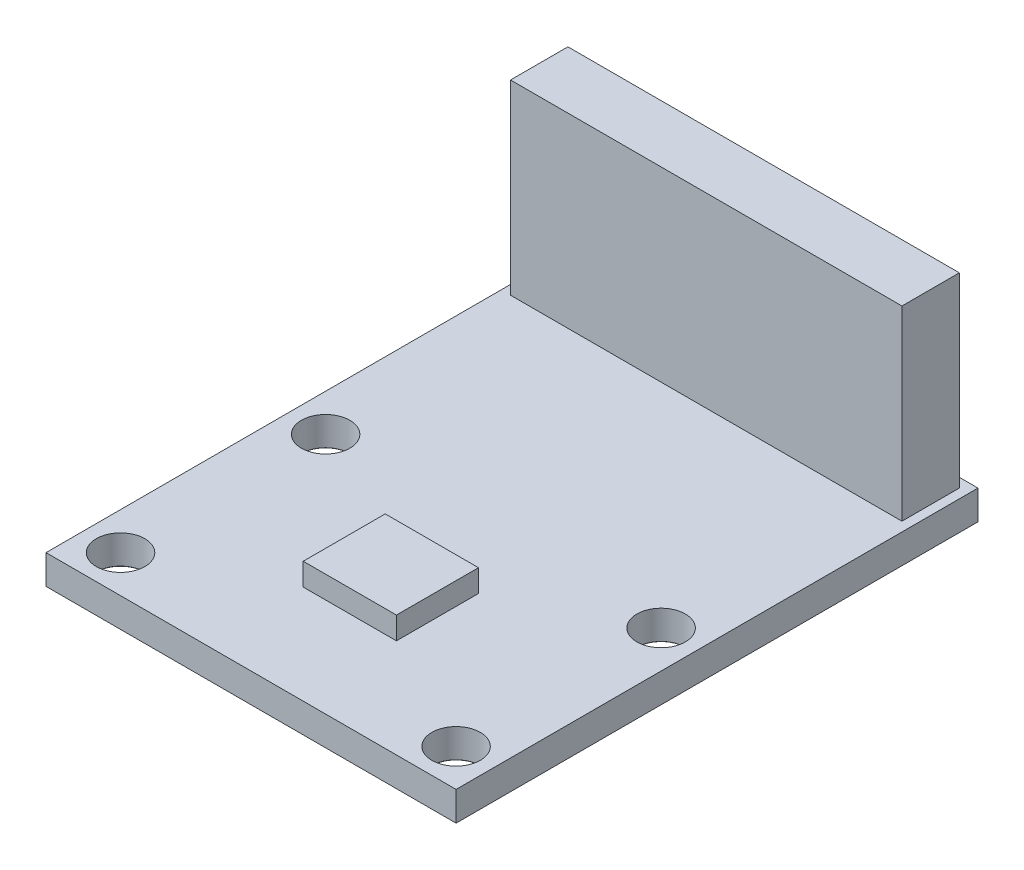
ISO-10303-21;
HEADER;
FILE_DESCRIPTION(('STEP AP214'),'2;1');
FILE_NAME('part.step','',(''),(''),'','','');
FILE_SCHEMA(('AUTOMOTIVE_DESIGN { 1 0 10303 214 1 1 1 1 }'));
ENDSEC;
DATA;
#1=APPLICATION_CONTEXT('core data for automotive mechanical design processes');
#2=APPLICATION_PROTOCOL_DEFINITION('international standard','automotive_design',2000,#1);
#3=PRODUCT_CONTEXT('',#1,'mechanical');
#4=PRODUCT('Part','Part','',(#3));
#5=PRODUCT_RELATED_PRODUCT_CATEGORY('part','',(#4));
#6=PRODUCT_DEFINITION_FORMATION('','',#4);
#7=PRODUCT_DEFINITION_CONTEXT('part definition',#1,'design');
#8=PRODUCT_DEFINITION('design','',#6,#7);
#9=PRODUCT_DEFINITION_SHAPE('','',#8);
#10=(LENGTH_UNIT() NAMED_UNIT(*) SI_UNIT(.MILLI.,.METRE.));
#11=(NAMED_UNIT(*) PLANE_ANGLE_UNIT() SI_UNIT($,.RADIAN.));
#12=(NAMED_UNIT(*) SI_UNIT($,.STERADIAN.) SOLID_ANGLE_UNIT());
#13=UNCERTAINTY_MEASURE_WITH_UNIT(LENGTH_MEASURE(1.E-05),#10,'distance_accuracy_value','');
#14=(GEOMETRIC_REPRESENTATION_CONTEXT(3) GLOBAL_UNCERTAINTY_ASSIGNED_CONTEXT((#13)) GLOBAL_UNIT_ASSIGNED_CONTEXT((#10,
#11,#12)) REPRESENTATION_CONTEXT('',''));
#15=CARTESIAN_POINT('',(0.,0.,0.));
#16=DIRECTION('',(0.,0.,1.));
#17=DIRECTION('',(1.,0.,0.));
#18=AXIS2_PLACEMENT_3D('',#15,#16,#17);
#19=CARTESIAN_POINT('',(0.,1.57,0.));
#20=DIRECTION('',(0.,1.,0.));
#21=DIRECTION('',(0.,0.,1.));
#22=AXIS2_PLACEMENT_3D('',#19,#20,#21);
#23=PLANE('',#22);
#24=CARTESIAN_POINT('',(-9.,1.57,-5.5));
#25=DIRECTION('',(0.,1.,0.));
#26=DIRECTION('',(0.,0.,1.));
#27=AXIS2_PLACEMENT_3D('',#24,#25,#26);
#28=CIRCLE('',#27,1.29999999999999);
#29=CARTESIAN_POINT('',(-9.,1.57,-4.20000000000001));
#30=VERTEX_POINT('',#29);
#31=EDGE_CURVE('E218',#30,#30,#28,.T.);
#32=ORIENTED_EDGE('',*,*,#31,.F.);
#33=EDGE_LOOP('',(#32));
#34=FACE_BOUND('',#33,.T.);
#35=CARTESIAN_POINT('',(-9.,1.57,5.5));
#36=DIRECTION('',(0.,1.,0.));
#37=DIRECTION('',(0.,0.,1.));
#38=AXIS2_PLACEMENT_3D('',#35,#36,#37);
#39=CIRCLE('',#38,1.29999999999999);
#40=CARTESIAN_POINT('',(-9.,1.57,6.79999999999999));
#41=VERTEX_POINT('',#40);
#42=EDGE_CURVE('E230',#41,#41,#39,.T.);
#43=ORIENTED_EDGE('',*,*,#42,.F.);
#44=EDGE_LOOP('',(#43));
#45=FACE_BOUND('',#44,.T.);
#46=CARTESIAN_POINT('',(9.,1.57,5.5));
#47=DIRECTION('',(0.,1.,0.));
#48=DIRECTION('',(0.,0.,1.));
#49=AXIS2_PLACEMENT_3D('',#46,#47,#48);
#50=CIRCLE('',#49,1.29999999999999);
#51=CARTESIAN_POINT('',(9.,1.57,6.79999999999999));
#52=VERTEX_POINT('',#51);
#53=EDGE_CURVE('E242',#52,#52,#50,.T.);
#54=ORIENTED_EDGE('',*,*,#53,.F.);
#55=EDGE_LOOP('',(#54));
#56=FACE_BOUND('',#55,.T.);
#57=CARTESIAN_POINT('',(9.,1.57,-5.5));
#58=DIRECTION('',(0.,1.,0.));
#59=DIRECTION('',(0.,0.,1.));
#60=AXIS2_PLACEMENT_3D('',#57,#58,#59);
#61=CIRCLE('',#60,1.29999999999999);
#62=CARTESIAN_POINT('',(9.,1.57,-4.20000000000001));
#63=VERTEX_POINT('',#62);
#64=EDGE_CURVE('E254',#63,#63,#61,.T.);
#65=ORIENTED_EDGE('',*,*,#64,.F.);
#66=EDGE_LOOP('',(#65));
#67=FACE_BOUND('',#66,.T.);
#68=DIRECTION('',(0.,0.,-1.));
#69=VECTOR('',#68,1.);
#70=CARTESIAN_POINT('',(11.,1.57,-20.5));
#71=LINE('',#70,#69);
#72=CARTESIAN_POINT('',(11.,1.57,7.5));
#73=VERTEX_POINT('',#72);
#74=CARTESIAN_POINT('',(11.,1.57,-20.5));
#75=VERTEX_POINT('',#74);
#76=EDGE_CURVE('E263',#73,#75,#71,.T.);
#77=ORIENTED_EDGE('',*,*,#76,.T.);
#78=DIRECTION('',(-1.,0.,0.));
#79=VECTOR('',#78,1.);
#80=CARTESIAN_POINT('',(-11.,1.57,-20.5));
#81=LINE('',#80,#79);
#82=CARTESIAN_POINT('',(-11.,1.57,-20.5));
#83=VERTEX_POINT('',#82);
#84=EDGE_CURVE('E267',#75,#83,#81,.T.);
#85=ORIENTED_EDGE('',*,*,#84,.T.);
#86=DIRECTION('',(0.,0.,1.));
#87=VECTOR('',#86,1.);
#88=CARTESIAN_POINT('',(-11.,1.57,-20.5));
#89=LINE('',#88,#87);
#90=CARTESIAN_POINT('',(-11.,1.57,7.5));
#91=VERTEX_POINT('',#90);
#92=EDGE_CURVE('E271',#83,#91,#89,.T.);
#93=ORIENTED_EDGE('',*,*,#92,.T.);
#94=DIRECTION('',(1.,0.,0.));
#95=VECTOR('',#94,1.);
#96=CARTESIAN_POINT('',(-11.,1.57,7.5));
#97=LINE('',#96,#95);
#98=EDGE_CURVE('E274',#91,#73,#97,.T.);
#99=ORIENTED_EDGE('',*,*,#98,.T.);
#100=EDGE_LOOP('',(#77,#85,#93,#99));
#101=FACE_BOUND('',#100,.T.);
#102=DIRECTION('',(-1.,0.,0.));
#103=VECTOR('',#102,1.);
#104=CARTESIAN_POINT('',(-2.5,1.57,-2.2));
#105=LINE('',#104,#103);
#106=CARTESIAN_POINT('',(2.5,1.57,-2.2));
#107=VERTEX_POINT('',#106);
#108=CARTESIAN_POINT('',(-2.5,1.57,-2.2));
#109=VERTEX_POINT('',#108);
#110=EDGE_CURVE('E175',#107,#109,#105,.T.);
#111=ORIENTED_EDGE('',*,*,#110,.F.);
#112=DIRECTION('',(0.,0.,-1.));
#113=VECTOR('',#112,1.);
#114=CARTESIAN_POINT('',(2.5,1.57,2.2));
#115=LINE('',#114,#113);
#116=CARTESIAN_POINT('',(2.5,1.57,2.2));
#117=VERTEX_POINT('',#116);
#118=EDGE_CURVE('E170',#117,#107,#115,.T.);
#119=ORIENTED_EDGE('',*,*,#118,.F.);
#120=DIRECTION('',(1.,0.,0.));
#121=VECTOR('',#120,1.);
#122=CARTESIAN_POINT('',(-2.5,1.57,2.2));
#123=LINE('',#122,#121);
#124=CARTESIAN_POINT('',(-2.5,1.57,2.2));
#125=VERTEX_POINT('',#124);
#126=EDGE_CURVE('E185',#125,#117,#123,.T.);
#127=ORIENTED_EDGE('',*,*,#126,.F.);
#128=DIRECTION('',(0.,0.,1.));
#129=VECTOR('',#128,1.);
#130=CARTESIAN_POINT('',(-2.5,1.57,2.2));
#131=LINE('',#130,#129);
#132=EDGE_CURVE('E197',#109,#125,#131,.T.);
#133=ORIENTED_EDGE('',*,*,#132,.F.);
#134=EDGE_LOOP('',(#111,#119,#127,#133));
#135=FACE_BOUND('',#134,.T.);
#136=DIRECTION('',(1.,0.,0.));
#137=VECTOR('',#136,1.);
#138=CARTESIAN_POINT('',(-10.5,1.57,-16.92));
#139=LINE('',#138,#137);
#140=CARTESIAN_POINT('',(-10.5,1.57,-16.92));
#141=VERTEX_POINT('',#140);
#142=CARTESIAN_POINT('',(10.5,1.57,-16.92));
#143=VERTEX_POINT('',#142);
#144=EDGE_CURVE('E601',#141,#143,#139,.T.);
#145=ORIENTED_EDGE('',*,*,#144,.F.);
#146=DIRECTION('',(0.,0.,1.));
#147=VECTOR('',#146,1.);
#148=CARTESIAN_POINT('',(-10.5,1.57,-20.));
#149=LINE('',#148,#147);
#150=CARTESIAN_POINT('',(-10.5,1.57,-20.));
#151=VERTEX_POINT('',#150);
#152=EDGE_CURVE('E167',#151,#141,#149,.T.);
#153=ORIENTED_EDGE('',*,*,#152,.F.);
#154=DIRECTION('',(-1.,0.,0.));
#155=VECTOR('',#154,1.);
#156=CARTESIAN_POINT('',(-10.5,1.57,-20.));
#157=LINE('',#156,#155);
#158=CARTESIAN_POINT('',(10.5,1.57,-20.));
#159=VERTEX_POINT('',#158);
#160=EDGE_CURVE('E163',#159,#151,#157,.T.);
#161=ORIENTED_EDGE('',*,*,#160,.F.);
#162=DIRECTION('',(0.,0.,-1.));
#163=VECTOR('',#162,1.);
#164=CARTESIAN_POINT('',(10.5,1.57,-20.));
#165=LINE('',#164,#163);
#166=EDGE_CURVE('E597',#143,#159,#165,.T.);
#167=ORIENTED_EDGE('',*,*,#166,.F.);
#168=EDGE_LOOP('',(#145,#153,#161,#167));
#169=FACE_BOUND('',#168,.T.);
#170=ADVANCED_FACE('F51',(#34,#45,#56,#67,#101,#135,#169),#23,.T.);
#171=CARTESIAN_POINT('',(11.,1.57,-20.5));
#172=DIRECTION('',(-1.,0.,0.));
#173=DIRECTION('',(0.,0.,1.));
#174=AXIS2_PLACEMENT_3D('',#171,#172,#173);
#175=PLANE('',#174);
#176=DIRECTION('',(0.,0.,-1.));
#177=VECTOR('',#176,1.);
#178=CARTESIAN_POINT('',(11.,0.,-20.5));
#179=LINE('',#178,#177);
#180=CARTESIAN_POINT('',(11.,0.,7.5));
#181=VERTEX_POINT('',#180);
#182=CARTESIAN_POINT('',(11.,0.,-20.5));
#183=VERTEX_POINT('',#182);
#184=EDGE_CURVE('E262',#181,#183,#179,.T.);
#185=ORIENTED_EDGE('',*,*,#184,.T.);
#186=DIRECTION('',(0.,-1.,0.));
#187=VECTOR('',#186,1.);
#188=CARTESIAN_POINT('',(11.,1.57,-20.5));
#189=LINE('',#188,#187);
#190=EDGE_CURVE('E11',#75,#183,#189,.T.);
#191=ORIENTED_EDGE('',*,*,#190,.F.);
#192=ORIENTED_EDGE('',*,*,#76,.F.);
#193=DIRECTION('',(0.,-1.,0.));
#194=VECTOR('',#193,1.);
#195=CARTESIAN_POINT('',(11.,1.57,7.5));
#196=LINE('',#195,#194);
#197=EDGE_CURVE('E277',#73,#181,#196,.T.);
#198=ORIENTED_EDGE('',*,*,#197,.T.);
#199=EDGE_LOOP('',(#185,#191,#192,#198));
#200=FACE_BOUND('',#199,.T.);
#201=ADVANCED_FACE('F53',(#200),#175,.F.);
#202=CARTESIAN_POINT('',(-11.,1.57,-20.5));
#203=DIRECTION('',(0.,0.,1.));
#204=DIRECTION('',(1.,0.,0.));
#205=AXIS2_PLACEMENT_3D('',#202,#203,#204);
#206=PLANE('',#205);
#207=DIRECTION('',(-1.,0.,0.));
#208=VECTOR('',#207,1.);
#209=CARTESIAN_POINT('',(-11.,0.,-20.5));
#210=LINE('',#209,#208);
#211=CARTESIAN_POINT('',(-11.,0.,-20.5));
#212=VERTEX_POINT('',#211);
#213=EDGE_CURVE('E281',#183,#212,#210,.T.);
#214=ORIENTED_EDGE('',*,*,#213,.T.);
#215=DIRECTION('',(0.,-1.,0.));
#216=VECTOR('',#215,1.);
#217=CARTESIAN_POINT('',(-11.,1.57,-20.5));
#218=LINE('',#217,#216);
#219=EDGE_CURVE('E60',#83,#212,#218,.T.);
#220=ORIENTED_EDGE('',*,*,#219,.F.);
#221=ORIENTED_EDGE('',*,*,#84,.F.);
#222=ORIENTED_EDGE('',*,*,#190,.T.);
#223=EDGE_LOOP('',(#214,#220,#221,#222));
#224=FACE_BOUND('',#223,.T.);
#225=ADVANCED_FACE('F317',(#224),#206,.F.);
#226=CARTESIAN_POINT('',(-11.,1.57,-20.5));
#227=DIRECTION('',(1.,0.,0.));
#228=DIRECTION('',(0.,0.,-1.));
#229=AXIS2_PLACEMENT_3D('',#226,#227,#228);
#230=PLANE('',#229);
#231=DIRECTION('',(0.,0.,1.));
#232=VECTOR('',#231,1.);
#233=CARTESIAN_POINT('',(-11.,0.,-20.5));
#234=LINE('',#233,#232);
#235=CARTESIAN_POINT('',(-11.,0.,7.5));
#236=VERTEX_POINT('',#235);
#237=EDGE_CURVE('E284',#212,#236,#234,.T.);
#238=ORIENTED_EDGE('',*,*,#237,.T.);
#239=DIRECTION('',(0.,-1.,0.));
#240=VECTOR('',#239,1.);
#241=CARTESIAN_POINT('',(-11.,1.57,7.5));
#242=LINE('',#241,#240);
#243=EDGE_CURVE('E292',#91,#236,#242,.T.);
#244=ORIENTED_EDGE('',*,*,#243,.F.);
#245=ORIENTED_EDGE('',*,*,#92,.F.);
#246=ORIENTED_EDGE('',*,*,#219,.T.);
#247=EDGE_LOOP('',(#238,#244,#245,#246));
#248=FACE_BOUND('',#247,.T.);
#249=ADVANCED_FACE('F301',(#248),#230,.F.);
#250=CARTESIAN_POINT('',(-11.,1.57,7.5));
#251=DIRECTION('',(0.,0.,-1.));
#252=DIRECTION('',(-1.,0.,0.));
#253=AXIS2_PLACEMENT_3D('',#250,#251,#252);
#254=PLANE('',#253);
#255=DIRECTION('',(1.,0.,0.));
#256=VECTOR('',#255,1.);
#257=CARTESIAN_POINT('',(-11.,0.,7.5));
#258=LINE('',#257,#256);
#259=EDGE_CURVE('E268',#236,#181,#258,.T.);
#260=ORIENTED_EDGE('',*,*,#259,.T.);
#261=ORIENTED_EDGE('',*,*,#197,.F.);
#262=ORIENTED_EDGE('',*,*,#98,.F.);
#263=ORIENTED_EDGE('',*,*,#243,.T.);
#264=EDGE_LOOP('',(#260,#261,#262,#263));
#265=FACE_BOUND('',#264,.T.);
#266=ADVANCED_FACE('F310',(#265),#254,.F.);
#267=CARTESIAN_POINT('',(0.,0.,0.));
#268=DIRECTION('',(0.,1.,0.));
#269=DIRECTION('',(0.,0.,1.));
#270=AXIS2_PLACEMENT_3D('',#267,#268,#269);
#271=PLANE('',#270);
#272=CARTESIAN_POINT('',(-9.,0.,-5.5));
#273=DIRECTION('',(0.,1.,0.));
#274=DIRECTION('',(0.,0.,1.));
#275=AXIS2_PLACEMENT_3D('',#272,#273,#274);
#276=CIRCLE('',#275,1.325);
#277=CARTESIAN_POINT('',(-9.,0.,-4.175));
#278=VERTEX_POINT('',#277);
#279=EDGE_CURVE('E214',#278,#278,#276,.T.);
#280=ORIENTED_EDGE('',*,*,#279,.T.);
#281=EDGE_LOOP('',(#280));
#282=FACE_BOUND('',#281,.T.);
#283=CARTESIAN_POINT('',(-9.,0.,5.5));
#284=DIRECTION('',(0.,1.,0.));
#285=DIRECTION('',(0.,0.,1.));
#286=AXIS2_PLACEMENT_3D('',#283,#284,#285);
#287=CIRCLE('',#286,1.325);
#288=CARTESIAN_POINT('',(-9.,0.,6.825));
#289=VERTEX_POINT('',#288);
#290=EDGE_CURVE('E226',#289,#289,#287,.T.);
#291=ORIENTED_EDGE('',*,*,#290,.T.);
#292=EDGE_LOOP('',(#291));
#293=FACE_BOUND('',#292,.T.);
#294=CARTESIAN_POINT('',(9.,0.,5.5));
#295=DIRECTION('',(0.,1.,0.));
#296=DIRECTION('',(0.,0.,1.));
#297=AXIS2_PLACEMENT_3D('',#294,#295,#296);
#298=CIRCLE('',#297,1.325);
#299=CARTESIAN_POINT('',(9.,0.,6.825));
#300=VERTEX_POINT('',#299);
#301=EDGE_CURVE('E238',#300,#300,#298,.T.);
#302=ORIENTED_EDGE('',*,*,#301,.T.);
#303=EDGE_LOOP('',(#302));
#304=FACE_BOUND('',#303,.T.);
#305=CARTESIAN_POINT('',(9.,0.,-5.5));
#306=DIRECTION('',(0.,1.,0.));
#307=DIRECTION('',(0.,0.,1.));
#308=AXIS2_PLACEMENT_3D('',#305,#306,#307);
#309=CIRCLE('',#308,1.325);
#310=CARTESIAN_POINT('',(9.,0.,-4.175));
#311=VERTEX_POINT('',#310);
#312=EDGE_CURVE('E250',#311,#311,#309,.T.);
#313=ORIENTED_EDGE('',*,*,#312,.T.);
#314=EDGE_LOOP('',(#313));
#315=FACE_BOUND('',#314,.T.);
#316=ORIENTED_EDGE('',*,*,#184,.F.);
#317=ORIENTED_EDGE('',*,*,#259,.F.);
#318=ORIENTED_EDGE('',*,*,#237,.F.);
#319=ORIENTED_EDGE('',*,*,#213,.F.);
#320=EDGE_LOOP('',(#316,#317,#318,#319));
#321=FACE_BOUND('',#320,.T.);
#322=ADVANCED_FACE('F307',(#282,#293,#304,#315,#321),#271,.F.);
#323=CARTESIAN_POINT('',(9.,0.0250000000000022,-5.5));
#324=DIRECTION('',(0.,-1.,0.));
#325=DIRECTION('',(0.,0.,-1.));
#326=AXIS2_PLACEMENT_3D('',#323,#324,#325);
#327=CONICAL_SURFACE('',#326,1.3,0.785398163397483);
#328=ORIENTED_EDGE('',*,*,#312,.F.);
#329=EDGE_LOOP('',(#328));
#330=FACE_BOUND('',#329,.T.);
#331=CARTESIAN_POINT('',(9.,0.0250000000000022,-5.5));
#332=DIRECTION('',(0.,1.,0.));
#333=DIRECTION('',(0.,0.,1.));
#334=AXIS2_PLACEMENT_3D('',#331,#332,#333);
#335=CIRCLE('',#334,1.3);
#336=CARTESIAN_POINT('',(9.,0.0250000000000022,-4.2));
#337=VERTEX_POINT('',#336);
#338=EDGE_CURVE('E258',#337,#337,#335,.T.);
#339=ORIENTED_EDGE('',*,*,#338,.T.);
#340=EDGE_LOOP('',(#339));
#341=FACE_BOUND('',#340,.T.);
#342=ADVANCED_FACE('F335',(#330,#341),#327,.F.);
#343=CARTESIAN_POINT('',(9.,1.57,-5.5));
#344=DIRECTION('',(0.,1.,0.));
#345=DIRECTION('',(0.,0.,1.));
#346=AXIS2_PLACEMENT_3D('',#343,#344,#345);
#347=CYLINDRICAL_SURFACE('',#346,1.29999999999999);
#348=ORIENTED_EDGE('',*,*,#338,.F.);
#349=EDGE_LOOP('',(#348));
#350=FACE_BOUND('',#349,.T.);
#351=ORIENTED_EDGE('',*,*,#64,.T.);
#352=EDGE_LOOP('',(#351));
#353=FACE_BOUND('',#352,.T.);
#354=ADVANCED_FACE('F357',(#350,#353),#347,.F.);
#355=CARTESIAN_POINT('',(9.,0.0250000000000022,5.5));
#356=DIRECTION('',(0.,-1.,0.));
#357=DIRECTION('',(0.,0.,-1.));
#358=AXIS2_PLACEMENT_3D('',#355,#356,#357);
#359=CONICAL_SURFACE('',#358,1.3,0.785398163397483);
#360=ORIENTED_EDGE('',*,*,#301,.F.);
#361=EDGE_LOOP('',(#360));
#362=FACE_BOUND('',#361,.T.);
#363=CARTESIAN_POINT('',(9.,0.0250000000000022,5.5));
#364=DIRECTION('',(0.,1.,0.));
#365=DIRECTION('',(0.,0.,1.));
#366=AXIS2_PLACEMENT_3D('',#363,#364,#365);
#367=CIRCLE('',#366,1.3);
#368=CARTESIAN_POINT('',(9.,0.0250000000000022,6.8));
#369=VERTEX_POINT('',#368);
#370=EDGE_CURVE('E246',#369,#369,#367,.T.);
#371=ORIENTED_EDGE('',*,*,#370,.T.);
#372=EDGE_LOOP('',(#371));
#373=FACE_BOUND('',#372,.T.);
#374=ADVANCED_FACE('F367',(#362,#373),#359,.F.);
#375=CARTESIAN_POINT('',(9.,1.57,5.5));
#376=DIRECTION('',(0.,1.,0.));
#377=DIRECTION('',(0.,0.,1.));
#378=AXIS2_PLACEMENT_3D('',#375,#376,#377);
#379=CYLINDRICAL_SURFACE('',#378,1.29999999999999);
#380=ORIENTED_EDGE('',*,*,#370,.F.);
#381=EDGE_LOOP('',(#380));
#382=FACE_BOUND('',#381,.T.);
#383=ORIENTED_EDGE('',*,*,#53,.T.);
#384=EDGE_LOOP('',(#383));
#385=FACE_BOUND('',#384,.T.);
#386=ADVANCED_FACE('F379',(#382,#385),#379,.F.);
#387=CARTESIAN_POINT('',(-9.,0.0250000000000022,5.5));
#388=DIRECTION('',(0.,-1.,0.));
#389=DIRECTION('',(0.,0.,-1.));
#390=AXIS2_PLACEMENT_3D('',#387,#388,#389);
#391=CONICAL_SURFACE('',#390,1.3,0.7853981633975);
#392=ORIENTED_EDGE('',*,*,#290,.F.);
#393=EDGE_LOOP('',(#392));
#394=FACE_BOUND('',#393,.T.);
#395=CARTESIAN_POINT('',(-9.,0.0250000000000022,5.5));
#396=DIRECTION('',(0.,1.,0.));
#397=DIRECTION('',(0.,0.,1.));
#398=AXIS2_PLACEMENT_3D('',#395,#396,#397);
#399=CIRCLE('',#398,1.3);
#400=CARTESIAN_POINT('',(-9.,0.0250000000000022,6.8));
#401=VERTEX_POINT('',#400);
#402=EDGE_CURVE('E234',#401,#401,#399,.T.);
#403=ORIENTED_EDGE('',*,*,#402,.T.);
#404=EDGE_LOOP('',(#403));
#405=FACE_BOUND('',#404,.T.);
#406=ADVANCED_FACE('F389',(#394,#405),#391,.F.);
#407=CARTESIAN_POINT('',(-9.,1.57,5.5));
#408=DIRECTION('',(0.,1.,0.));
#409=DIRECTION('',(0.,0.,1.));
#410=AXIS2_PLACEMENT_3D('',#407,#408,#409);
#411=CYLINDRICAL_SURFACE('',#410,1.29999999999999);
#412=ORIENTED_EDGE('',*,*,#402,.F.);
#413=EDGE_LOOP('',(#412));
#414=FACE_BOUND('',#413,.T.);
#415=ORIENTED_EDGE('',*,*,#42,.T.);
#416=EDGE_LOOP('',(#415));
#417=FACE_BOUND('',#416,.T.);
#418=ADVANCED_FACE('F401',(#414,#417),#411,.F.);
#419=CARTESIAN_POINT('',(-9.,0.0250000000000022,-5.5));
#420=DIRECTION('',(0.,-1.,0.));
#421=DIRECTION('',(0.,0.,-1.));
#422=AXIS2_PLACEMENT_3D('',#419,#420,#421);
#423=CONICAL_SURFACE('',#422,1.3,0.7853981633975);
#424=ORIENTED_EDGE('',*,*,#279,.F.);
#425=EDGE_LOOP('',(#424));
#426=FACE_BOUND('',#425,.T.);
#427=CARTESIAN_POINT('',(-9.,0.0250000000000022,-5.5));
#428=DIRECTION('',(0.,1.,0.));
#429=DIRECTION('',(0.,0.,1.));
#430=AXIS2_PLACEMENT_3D('',#427,#428,#429);
#431=CIRCLE('',#430,1.3);
#432=CARTESIAN_POINT('',(-9.,0.0250000000000022,-4.2));
#433=VERTEX_POINT('',#432);
#434=EDGE_CURVE('E222',#433,#433,#431,.T.);
#435=ORIENTED_EDGE('',*,*,#434,.T.);
#436=EDGE_LOOP('',(#435));
#437=FACE_BOUND('',#436,.T.);
#438=ADVANCED_FACE('F411',(#426,#437),#423,.F.);
#439=CARTESIAN_POINT('',(-9.,1.57,-5.5));
#440=DIRECTION('',(0.,1.,0.));
#441=DIRECTION('',(0.,0.,1.));
#442=AXIS2_PLACEMENT_3D('',#439,#440,#441);
#443=CYLINDRICAL_SURFACE('',#442,1.29999999999999);
#444=ORIENTED_EDGE('',*,*,#434,.F.);
#445=EDGE_LOOP('',(#444));
#446=FACE_BOUND('',#445,.T.);
#447=ORIENTED_EDGE('',*,*,#31,.T.);
#448=EDGE_LOOP('',(#447));
#449=FACE_BOUND('',#448,.T.);
#450=ADVANCED_FACE('F422',(#446,#449),#443,.F.);
#451=CARTESIAN_POINT('',(2.5,2.77,2.2));
#452=DIRECTION('',(-1.,0.,0.));
#453=DIRECTION('',(0.,0.,1.));
#454=AXIS2_PLACEMENT_3D('',#451,#452,#453);
#455=PLANE('',#454);
#456=ORIENTED_EDGE('',*,*,#118,.T.);
#457=DIRECTION('',(0.,-1.,0.));
#458=VECTOR('',#457,1.);
#459=CARTESIAN_POINT('',(2.5,2.77,-2.2));
#460=LINE('',#459,#458);
#461=CARTESIAN_POINT('',(2.5,2.77,-2.2));
#462=VERTEX_POINT('',#461);
#463=EDGE_CURVE('E211',#462,#107,#460,.T.);
#464=ORIENTED_EDGE('',*,*,#463,.F.);
#465=DIRECTION('',(0.,0.,-1.));
#466=VECTOR('',#465,1.);
#467=CARTESIAN_POINT('',(2.5,2.77,2.2));
#468=LINE('',#467,#466);
#469=CARTESIAN_POINT('',(2.5,2.77,2.2));
#470=VERTEX_POINT('',#469);
#471=EDGE_CURVE('E180',#470,#462,#468,.T.);
#472=ORIENTED_EDGE('',*,*,#471,.F.);
#473=DIRECTION('',(0.,-1.,0.));
#474=VECTOR('',#473,1.);
#475=CARTESIAN_POINT('',(2.5,2.77,2.2));
#476=LINE('',#475,#474);
#477=EDGE_CURVE('E193',#470,#117,#476,.T.);
#478=ORIENTED_EDGE('',*,*,#477,.T.);
#479=EDGE_LOOP('',(#456,#464,#472,#478));
#480=FACE_BOUND('',#479,.T.);
#481=ADVANCED_FACE('F432',(#480),#455,.F.);
#482=CARTESIAN_POINT('',(-2.5,2.77,-2.2));
#483=DIRECTION('',(0.,0.,1.));
#484=DIRECTION('',(1.,0.,0.));
#485=AXIS2_PLACEMENT_3D('',#482,#483,#484);
#486=PLANE('',#485);
#487=ORIENTED_EDGE('',*,*,#110,.T.);
#488=DIRECTION('',(0.,-1.,0.));
#489=VECTOR('',#488,1.);
#490=CARTESIAN_POINT('',(-2.5,2.77,-2.2));
#491=LINE('',#490,#489);
#492=CARTESIAN_POINT('',(-2.5,2.77,-2.2));
#493=VERTEX_POINT('',#492);
#494=EDGE_CURVE('E207',#493,#109,#491,.T.);
#495=ORIENTED_EDGE('',*,*,#494,.F.);
#496=DIRECTION('',(-1.,0.,0.));
#497=VECTOR('',#496,1.);
#498=CARTESIAN_POINT('',(-2.5,2.77,-2.2));
#499=LINE('',#498,#497);
#500=EDGE_CURVE('E184',#462,#493,#499,.T.);
#501=ORIENTED_EDGE('',*,*,#500,.F.);
#502=ORIENTED_EDGE('',*,*,#463,.T.);
#503=EDGE_LOOP('',(#487,#495,#501,#502));
#504=FACE_BOUND('',#503,.T.);
#505=ADVANCED_FACE('F445',(#504),#486,.F.);
#506=CARTESIAN_POINT('',(-2.5,2.77,2.2));
#507=DIRECTION('',(1.,0.,0.));
#508=DIRECTION('',(0.,0.,-1.));
#509=AXIS2_PLACEMENT_3D('',#506,#507,#508);
#510=PLANE('',#509);
#511=ORIENTED_EDGE('',*,*,#132,.T.);
#512=DIRECTION('',(0.,-1.,0.));
#513=VECTOR('',#512,1.);
#514=CARTESIAN_POINT('',(-2.5,2.77,2.2));
#515=LINE('',#514,#513);
#516=CARTESIAN_POINT('',(-2.5,2.77,2.2));
#517=VERTEX_POINT('',#516);
#518=EDGE_CURVE('E75',#517,#125,#515,.T.);
#519=ORIENTED_EDGE('',*,*,#518,.F.);
#520=DIRECTION('',(0.,0.,1.));
#521=VECTOR('',#520,1.);
#522=CARTESIAN_POINT('',(-2.5,2.77,2.2));
#523=LINE('',#522,#521);
#524=EDGE_CURVE('E188',#493,#517,#523,.T.);
#525=ORIENTED_EDGE('',*,*,#524,.F.);
#526=ORIENTED_EDGE('',*,*,#494,.T.);
#527=EDGE_LOOP('',(#511,#519,#525,#526));
#528=FACE_BOUND('',#527,.T.);
#529=ADVANCED_FACE('F457',(#528),#510,.F.);
#530=CARTESIAN_POINT('',(-2.5,2.77,2.2));
#531=DIRECTION('',(0.,0.,-1.));
#532=DIRECTION('',(-1.,0.,0.));
#533=AXIS2_PLACEMENT_3D('',#530,#531,#532);
#534=PLANE('',#533);
#535=ORIENTED_EDGE('',*,*,#126,.T.);
#536=ORIENTED_EDGE('',*,*,#477,.F.);
#537=DIRECTION('',(1.,0.,0.));
#538=VECTOR('',#537,1.);
#539=CARTESIAN_POINT('',(-2.5,2.77,2.2));
#540=LINE('',#539,#538);
#541=EDGE_CURVE('E191',#517,#470,#540,.T.);
#542=ORIENTED_EDGE('',*,*,#541,.F.);
#543=ORIENTED_EDGE('',*,*,#518,.T.);
#544=EDGE_LOOP('',(#535,#536,#542,#543));
#545=FACE_BOUND('',#544,.T.);
#546=ADVANCED_FACE('F469',(#545),#534,.F.);
#547=CARTESIAN_POINT('',(0.,2.77,0.));
#548=DIRECTION('',(0.,-1.,0.));
#549=DIRECTION('',(0.,0.,-1.));
#550=AXIS2_PLACEMENT_3D('',#547,#548,#549);
#551=PLANE('',#550);
#552=ORIENTED_EDGE('',*,*,#471,.T.);
#553=ORIENTED_EDGE('',*,*,#500,.T.);
#554=ORIENTED_EDGE('',*,*,#524,.T.);
#555=ORIENTED_EDGE('',*,*,#541,.T.);
#556=EDGE_LOOP('',(#552,#553,#554,#555));
#557=FACE_BOUND('',#556,.T.);
#558=ADVANCED_FACE('F480',(#557),#551,.F.);
#559=CARTESIAN_POINT('',(-10.5,11.57,-20.));
#560=DIRECTION('',(1.,0.,0.));
#561=DIRECTION('',(0.,0.,-1.));
#562=AXIS2_PLACEMENT_3D('',#559,#560,#561);
#563=PLANE('',#562);
#564=ORIENTED_EDGE('',*,*,#152,.T.);
#565=DIRECTION('',(0.,-1.,0.));
#566=VECTOR('',#565,1.);
#567=CARTESIAN_POINT('',(-10.5,11.57,-16.92));
#568=LINE('',#567,#566);
#569=CARTESIAN_POINT('',(-10.5,11.57,-16.92));
#570=VERTEX_POINT('',#569);
#571=EDGE_CURVE('E146',#570,#141,#568,.T.);
#572=ORIENTED_EDGE('',*,*,#571,.F.);
#573=DIRECTION('',(0.,0.,1.));
#574=VECTOR('',#573,1.);
#575=CARTESIAN_POINT('',(-10.5,11.57,-20.));
#576=LINE('',#575,#574);
#577=CARTESIAN_POINT('',(-10.5,11.57,-20.));
#578=VERTEX_POINT('',#577);
#579=EDGE_CURVE('E154',#578,#570,#576,.T.);
#580=ORIENTED_EDGE('',*,*,#579,.F.);
#581=DIRECTION('',(0.,-1.,0.));
#582=VECTOR('',#581,1.);
#583=CARTESIAN_POINT('',(-10.5,11.57,-20.));
#584=LINE('',#583,#582);
#585=EDGE_CURVE('E593',#578,#151,#584,.T.);
#586=ORIENTED_EDGE('',*,*,#585,.T.);
#587=EDGE_LOOP('',(#564,#572,#580,#586));
#588=FACE_BOUND('',#587,.T.);
#589=ADVANCED_FACE('F165',(#588),#563,.F.);
#590=CARTESIAN_POINT('',(-10.5,11.57,-16.92));
#591=DIRECTION('',(0.,0.,-1.));
#592=DIRECTION('',(-1.,0.,0.));
#593=AXIS2_PLACEMENT_3D('',#590,#591,#592);
#594=PLANE('',#593);
#595=ORIENTED_EDGE('',*,*,#144,.T.);
#596=DIRECTION('',(0.,-1.,0.));
#597=VECTOR('',#596,1.);
#598=CARTESIAN_POINT('',(10.5,11.57,-16.92));
#599=LINE('',#598,#597);
#600=CARTESIAN_POINT('',(10.5,11.57,-16.92));
#601=VERTEX_POINT('',#600);
#602=EDGE_CURVE('E149',#601,#143,#599,.T.);
#603=ORIENTED_EDGE('',*,*,#602,.F.);
#604=DIRECTION('',(1.,0.,0.));
#605=VECTOR('',#604,1.);
#606=CARTESIAN_POINT('',(-10.5,11.57,-16.92));
#607=LINE('',#606,#605);
#608=EDGE_CURVE('E142',#570,#601,#607,.T.);
#609=ORIENTED_EDGE('',*,*,#608,.F.);
#610=ORIENTED_EDGE('',*,*,#571,.T.);
#611=EDGE_LOOP('',(#595,#603,#609,#610));
#612=FACE_BOUND('',#611,.T.);
#613=ADVANCED_FACE('F144',(#612),#594,.F.);
#614=CARTESIAN_POINT('',(10.5,11.57,-20.));
#615=DIRECTION('',(-1.,0.,0.));
#616=DIRECTION('',(0.,0.,1.));
#617=AXIS2_PLACEMENT_3D('',#614,#615,#616);
#618=PLANE('',#617);
#619=ORIENTED_EDGE('',*,*,#166,.T.);
#620=DIRECTION('',(0.,-1.,0.));
#621=VECTOR('',#620,1.);
#622=CARTESIAN_POINT('',(10.5,11.57,-20.));
#623=LINE('',#622,#621);
#624=CARTESIAN_POINT('',(10.5,11.57,-20.));
#625=VERTEX_POINT('',#624);
#626=EDGE_CURVE('E67',#625,#159,#623,.T.);
#627=ORIENTED_EDGE('',*,*,#626,.F.);
#628=DIRECTION('',(0.,0.,-1.));
#629=VECTOR('',#628,1.);
#630=CARTESIAN_POINT('',(10.5,11.57,-20.));
#631=LINE('',#630,#629);
#632=EDGE_CURVE('E153',#601,#625,#631,.T.);
#633=ORIENTED_EDGE('',*,*,#632,.F.);
#634=ORIENTED_EDGE('',*,*,#602,.T.);
#635=EDGE_LOOP('',(#619,#627,#633,#634));
#636=FACE_BOUND('',#635,.T.);
#637=ADVANCED_FACE('F509',(#636),#618,.F.);
#638=CARTESIAN_POINT('',(-10.5,11.57,-20.));
#639=DIRECTION('',(0.,0.,1.));
#640=DIRECTION('',(1.,0.,0.));
#641=AXIS2_PLACEMENT_3D('',#638,#639,#640);
#642=PLANE('',#641);
#643=ORIENTED_EDGE('',*,*,#160,.T.);
#644=ORIENTED_EDGE('',*,*,#585,.F.);
#645=DIRECTION('',(-1.,0.,0.));
#646=VECTOR('',#645,1.);
#647=CARTESIAN_POINT('',(-10.5,11.57,-20.));
#648=LINE('',#647,#646);
#649=EDGE_CURVE('E158',#625,#578,#648,.T.);
#650=ORIENTED_EDGE('',*,*,#649,.F.);
#651=ORIENTED_EDGE('',*,*,#626,.T.);
#652=EDGE_LOOP('',(#643,#644,#650,#651));
#653=FACE_BOUND('',#652,.T.);
#654=ADVANCED_FACE('F518',(#653),#642,.F.);
#655=CARTESIAN_POINT('',(0.,11.57,0.));
#656=DIRECTION('',(0.,1.,0.));
#657=DIRECTION('',(0.,0.,1.));
#658=AXIS2_PLACEMENT_3D('',#655,#656,#657);
#659=PLANE('',#658);
#660=ORIENTED_EDGE('',*,*,#579,.T.);
#661=ORIENTED_EDGE('',*,*,#608,.T.);
#662=ORIENTED_EDGE('',*,*,#632,.T.);
#663=ORIENTED_EDGE('',*,*,#649,.T.);
#664=EDGE_LOOP('',(#660,#661,#662,#663));
#665=FACE_BOUND('',#664,.T.);
#666=ADVANCED_FACE('F157',(#665),#659,.T.);
#667=CLOSED_SHELL('',(#170,#201,#225,#249,#266,#322,#342,#354,#374,#386,#406,#418,#438,#450,
#481,#505,#529,#546,#558,#589,#613,#637,#654,#666));
#668=MANIFOLD_SOLID_BREP('B2',#667);
#669=ADVANCED_BREP_SHAPE_REPRESENTATION('',(#18,#668),#14);
#670=SHAPE_DEFINITION_REPRESENTATION(#9,#669);
ENDSEC;
END-ISO-10303-21;
